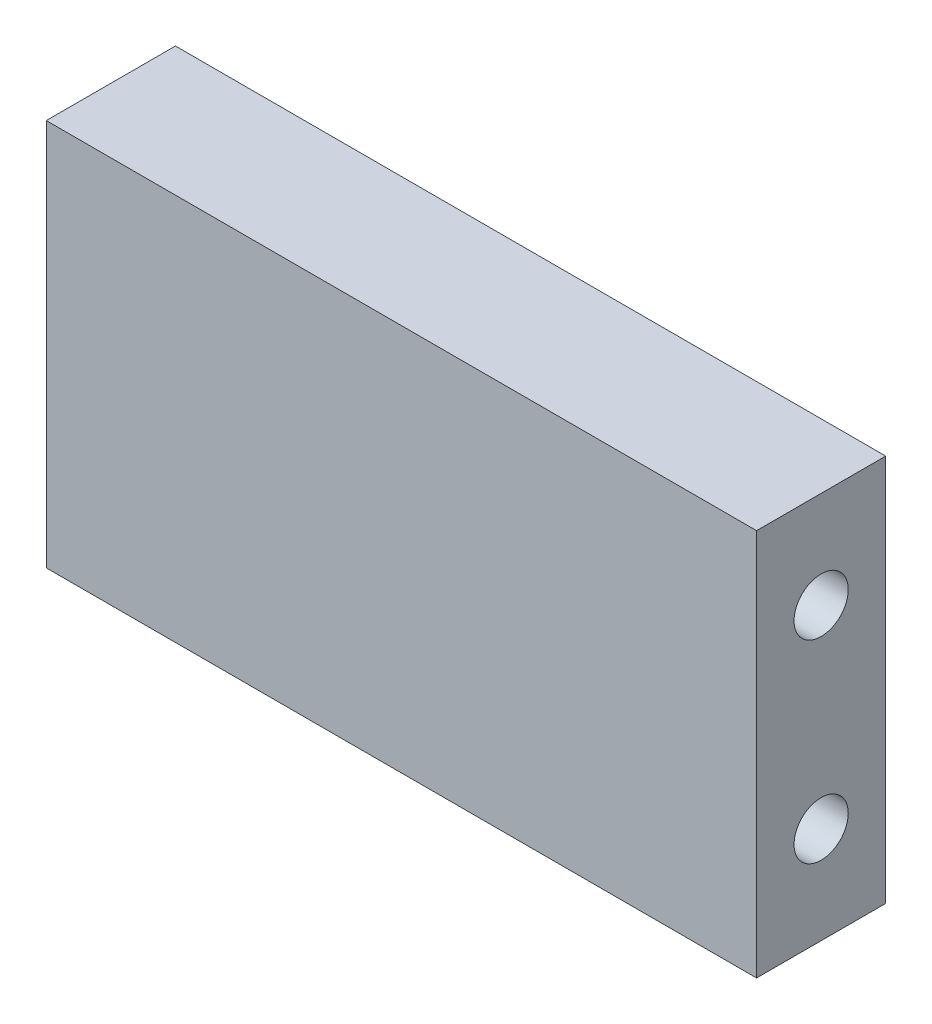
ISO-10303-21;
HEADER;
FILE_DESCRIPTION(('STEP AP214'),'2;1');
FILE_NAME('part.step','',(''),(''),'','','');
FILE_SCHEMA(('AUTOMOTIVE_DESIGN { 1 0 10303 214 1 1 1 1 }'));
ENDSEC;
DATA;
#1=APPLICATION_CONTEXT('core data for automotive mechanical design processes');
#2=APPLICATION_PROTOCOL_DEFINITION('international standard','automotive_design',2000,#1);
#3=PRODUCT_CONTEXT('',#1,'mechanical');
#4=PRODUCT('Part','Part','',(#3));
#5=PRODUCT_RELATED_PRODUCT_CATEGORY('part','',(#4));
#6=PRODUCT_DEFINITION_FORMATION('','',#4);
#7=PRODUCT_DEFINITION_CONTEXT('part definition',#1,'design');
#8=PRODUCT_DEFINITION('design','',#6,#7);
#9=PRODUCT_DEFINITION_SHAPE('','',#8);
#10=(LENGTH_UNIT() NAMED_UNIT(*) SI_UNIT(.MILLI.,.METRE.));
#11=(NAMED_UNIT(*) PLANE_ANGLE_UNIT() SI_UNIT($,.RADIAN.));
#12=(NAMED_UNIT(*) SI_UNIT($,.STERADIAN.) SOLID_ANGLE_UNIT());
#13=UNCERTAINTY_MEASURE_WITH_UNIT(LENGTH_MEASURE(1.E-05),#10,'distance_accuracy_value','');
#14=(GEOMETRIC_REPRESENTATION_CONTEXT(3) GLOBAL_UNCERTAINTY_ASSIGNED_CONTEXT((#13)) GLOBAL_UNIT_ASSIGNED_CONTEXT((#10,
#11,#12)) REPRESENTATION_CONTEXT('',''));
#15=CARTESIAN_POINT('',(0.,0.,0.));
#16=DIRECTION('',(0.,0.,1.));
#17=DIRECTION('',(1.,0.,0.));
#18=AXIS2_PLACEMENT_3D('',#15,#16,#17);
#19=CARTESIAN_POINT('',(27.5,-15.,10.));
#20=DIRECTION('',(-1.,0.,0.));
#21=DIRECTION('',(0.,0.,1.));
#22=AXIS2_PLACEMENT_3D('',#19,#20,#21);
#23=PLANE('',#22);
#24=CARTESIAN_POINT('',(27.5,7.5,5.));
#25=DIRECTION('',(1.,0.,0.));
#26=DIRECTION('',(0.,0.,-1.));
#27=AXIS2_PLACEMENT_3D('',#24,#25,#26);
#28=CIRCLE('',#27,2.09999999999999);
#29=CARTESIAN_POINT('',(27.5,7.5,2.90000000000001));
#30=VERTEX_POINT('',#29);
#31=EDGE_CURVE('E118',#30,#30,#28,.T.);
#32=ORIENTED_EDGE('',*,*,#31,.F.);
#33=EDGE_LOOP('',(#32));
#34=FACE_BOUND('',#33,.T.);
#35=CARTESIAN_POINT('',(27.5,-7.5,5.));
#36=DIRECTION('',(1.,0.,0.));
#37=DIRECTION('',(0.,0.,-1.));
#38=AXIS2_PLACEMENT_3D('',#35,#36,#37);
#39=CIRCLE('',#38,2.09999999999999);
#40=CARTESIAN_POINT('',(27.5,-7.5,2.90000000000001));
#41=VERTEX_POINT('',#40);
#42=EDGE_CURVE('E117',#41,#41,#39,.T.);
#43=ORIENTED_EDGE('',*,*,#42,.F.);
#44=EDGE_LOOP('',(#43));
#45=FACE_BOUND('',#44,.T.);
#46=DIRECTION('',(0.,1.,0.));
#47=VECTOR('',#46,1.);
#48=CARTESIAN_POINT('',(27.5,-15.,0.));
#49=LINE('',#48,#47);
#50=CARTESIAN_POINT('',(27.5,-15.,0.));
#51=VERTEX_POINT('',#50);
#52=CARTESIAN_POINT('',(27.5,15.,0.));
#53=VERTEX_POINT('',#52);
#54=EDGE_CURVE('E147',#51,#53,#49,.T.);
#55=ORIENTED_EDGE('',*,*,#54,.T.);
#56=DIRECTION('',(0.,0.,-1.));
#57=VECTOR('',#56,1.);
#58=CARTESIAN_POINT('',(27.5,15.,10.));
#59=LINE('',#58,#57);
#60=CARTESIAN_POINT('',(27.5,15.,10.));
#61=VERTEX_POINT('',#60);
#62=EDGE_CURVE('E11',#61,#53,#59,.T.);
#63=ORIENTED_EDGE('',*,*,#62,.F.);
#64=DIRECTION('',(0.,1.,0.));
#65=VECTOR('',#64,1.);
#66=CARTESIAN_POINT('',(27.5,-15.,10.));
#67=LINE('',#66,#65);
#68=CARTESIAN_POINT('',(27.5,-15.,10.));
#69=VERTEX_POINT('',#68);
#70=EDGE_CURVE('E148',#69,#61,#67,.T.);
#71=ORIENTED_EDGE('',*,*,#70,.F.);
#72=DIRECTION('',(0.,0.,-1.));
#73=VECTOR('',#72,1.);
#74=CARTESIAN_POINT('',(27.5,-15.,10.));
#75=LINE('',#74,#73);
#76=EDGE_CURVE('E158',#69,#51,#75,.T.);
#77=ORIENTED_EDGE('',*,*,#76,.T.);
#78=EDGE_LOOP('',(#55,#63,#71,#77));
#79=FACE_BOUND('',#78,.T.);
#80=ADVANCED_FACE('F45',(#34,#45,#79),#23,.F.);
#81=CARTESIAN_POINT('',(-27.5,15.,10.));
#82=DIRECTION('',(0.,-1.,0.));
#83=DIRECTION('',(0.,0.,-1.));
#84=AXIS2_PLACEMENT_3D('',#81,#82,#83);
#85=PLANE('',#84);
#86=DIRECTION('',(-1.,0.,0.));
#87=VECTOR('',#86,1.);
#88=CARTESIAN_POINT('',(-27.5,15.,0.));
#89=LINE('',#88,#87);
#90=CARTESIAN_POINT('',(-27.5,15.,0.));
#91=VERTEX_POINT('',#90);
#92=EDGE_CURVE('E162',#53,#91,#89,.T.);
#93=ORIENTED_EDGE('',*,*,#92,.T.);
#94=DIRECTION('',(0.,0.,-1.));
#95=VECTOR('',#94,1.);
#96=CARTESIAN_POINT('',(-27.5,15.,10.));
#97=LINE('',#96,#95);
#98=CARTESIAN_POINT('',(-27.5,15.,10.));
#99=VERTEX_POINT('',#98);
#100=EDGE_CURVE('E54',#99,#91,#97,.T.);
#101=ORIENTED_EDGE('',*,*,#100,.F.);
#102=DIRECTION('',(-1.,0.,0.));
#103=VECTOR('',#102,1.);
#104=CARTESIAN_POINT('',(-27.5,15.,10.));
#105=LINE('',#104,#103);
#106=EDGE_CURVE('E93',#61,#99,#105,.T.);
#107=ORIENTED_EDGE('',*,*,#106,.F.);
#108=ORIENTED_EDGE('',*,*,#62,.T.);
#109=EDGE_LOOP('',(#93,#101,#107,#108));
#110=FACE_BOUND('',#109,.T.);
#111=ADVANCED_FACE('F191',(#110),#85,.F.);
#112=CARTESIAN_POINT('',(-27.5,-15.,10.));
#113=DIRECTION('',(1.,0.,0.));
#114=DIRECTION('',(0.,0.,-1.));
#115=AXIS2_PLACEMENT_3D('',#112,#113,#114);
#116=PLANE('',#115);
#117=CARTESIAN_POINT('',(-27.5,7.5,5.));
#118=DIRECTION('',(-1.,0.,0.));
#119=DIRECTION('',(0.,0.,1.));
#120=AXIS2_PLACEMENT_3D('',#117,#118,#119);
#121=CIRCLE('',#120,2.09999999999999);
#122=CARTESIAN_POINT('',(-27.5,7.5,7.09999999999999));
#123=VERTEX_POINT('',#122);
#124=EDGE_CURVE('E131',#123,#123,#121,.T.);
#125=ORIENTED_EDGE('',*,*,#124,.F.);
#126=EDGE_LOOP('',(#125));
#127=FACE_BOUND('',#126,.T.);
#128=CARTESIAN_POINT('',(-27.5,-7.5,5.));
#129=DIRECTION('',(-1.,0.,0.));
#130=DIRECTION('',(0.,0.,1.));
#131=AXIS2_PLACEMENT_3D('',#128,#129,#130);
#132=CIRCLE('',#131,2.09999999999999);
#133=CARTESIAN_POINT('',(-27.5,-7.5,7.09999999999999));
#134=VERTEX_POINT('',#133);
#135=EDGE_CURVE('E139',#134,#134,#132,.T.);
#136=ORIENTED_EDGE('',*,*,#135,.F.);
#137=EDGE_LOOP('',(#136));
#138=FACE_BOUND('',#137,.T.);
#139=DIRECTION('',(0.,-1.,0.));
#140=VECTOR('',#139,1.);
#141=CARTESIAN_POINT('',(-27.5,-15.,0.));
#142=LINE('',#141,#140);
#143=CARTESIAN_POINT('',(-27.5,-15.,0.));
#144=VERTEX_POINT('',#143);
#145=EDGE_CURVE('E80',#91,#144,#142,.T.);
#146=ORIENTED_EDGE('',*,*,#145,.T.);
#147=DIRECTION('',(0.,0.,-1.));
#148=VECTOR('',#147,1.);
#149=CARTESIAN_POINT('',(-27.5,-15.,10.));
#150=LINE('',#149,#148);
#151=CARTESIAN_POINT('',(-27.5,-15.,10.));
#152=VERTEX_POINT('',#151);
#153=EDGE_CURVE('E171',#152,#144,#150,.T.);
#154=ORIENTED_EDGE('',*,*,#153,.F.);
#155=DIRECTION('',(0.,-1.,0.));
#156=VECTOR('',#155,1.);
#157=CARTESIAN_POINT('',(-27.5,-15.,10.));
#158=LINE('',#157,#156);
#159=EDGE_CURVE('E153',#99,#152,#158,.T.);
#160=ORIENTED_EDGE('',*,*,#159,.F.);
#161=ORIENTED_EDGE('',*,*,#100,.T.);
#162=EDGE_LOOP('',(#146,#154,#160,#161));
#163=FACE_BOUND('',#162,.T.);
#164=ADVANCED_FACE('F175',(#127,#138,#163),#116,.F.);
#165=CARTESIAN_POINT('',(-27.5,-15.,10.));
#166=DIRECTION('',(0.,1.,0.));
#167=DIRECTION('',(0.,0.,1.));
#168=AXIS2_PLACEMENT_3D('',#165,#166,#167);
#169=PLANE('',#168);
#170=DIRECTION('',(1.,0.,0.));
#171=VECTOR('',#170,1.);
#172=CARTESIAN_POINT('',(-27.5,-15.,0.));
#173=LINE('',#172,#171);
#174=EDGE_CURVE('E86',#144,#51,#173,.T.);
#175=ORIENTED_EDGE('',*,*,#174,.T.);
#176=ORIENTED_EDGE('',*,*,#76,.F.);
#177=DIRECTION('',(1.,0.,0.));
#178=VECTOR('',#177,1.);
#179=CARTESIAN_POINT('',(-27.5,-15.,10.));
#180=LINE('',#179,#178);
#181=EDGE_CURVE('E62',#152,#69,#180,.T.);
#182=ORIENTED_EDGE('',*,*,#181,.F.);
#183=ORIENTED_EDGE('',*,*,#153,.T.);
#184=EDGE_LOOP('',(#175,#176,#182,#183));
#185=FACE_BOUND('',#184,.T.);
#186=ADVANCED_FACE('F182',(#185),#169,.F.);
#187=CARTESIAN_POINT('',(0.,0.,10.));
#188=DIRECTION('',(0.,0.,-1.));
#189=DIRECTION('',(-1.,0.,0.));
#190=AXIS2_PLACEMENT_3D('',#187,#188,#189);
#191=PLANE('',#190);
#192=ORIENTED_EDGE('',*,*,#70,.T.);
#193=ORIENTED_EDGE('',*,*,#106,.T.);
#194=ORIENTED_EDGE('',*,*,#159,.T.);
#195=ORIENTED_EDGE('',*,*,#181,.T.);
#196=EDGE_LOOP('',(#192,#193,#194,#195));
#197=FACE_BOUND('',#196,.T.);
#198=ADVANCED_FACE('F184',(#197),#191,.F.);
#199=CARTESIAN_POINT('',(0.,0.,0.));
#200=DIRECTION('',(0.,0.,-1.));
#201=DIRECTION('',(-1.,0.,0.));
#202=AXIS2_PLACEMENT_3D('',#199,#200,#201);
#203=PLANE('',#202);
#204=ORIENTED_EDGE('',*,*,#54,.F.);
#205=ORIENTED_EDGE('',*,*,#174,.F.);
#206=ORIENTED_EDGE('',*,*,#145,.F.);
#207=ORIENTED_EDGE('',*,*,#92,.F.);
#208=EDGE_LOOP('',(#204,#205,#206,#207));
#209=FACE_BOUND('',#208,.T.);
#210=ADVANCED_FACE('F178',(#209),#203,.T.);
#211=CARTESIAN_POINT('',(-13.5,-7.5,5.));
#212=DIRECTION('',(-1.,0.,0.));
#213=DIRECTION('',(0.,0.,1.));
#214=AXIS2_PLACEMENT_3D('',#211,#212,#213);
#215=CONICAL_SURFACE('',#214,2.09999999999999,1.02974425867665);
#216=CARTESIAN_POINT('',(-12.2381927000421,-7.5,5.));
#217=VERTEX_POINT('',#216);
#218=VERTEX_LOOP('',#217);
#219=FACE_BOUND('',#218,.T.);
#220=CARTESIAN_POINT('',(-13.5,-7.5,5.));
#221=DIRECTION('',(-1.,0.,0.));
#222=DIRECTION('',(0.,0.,1.));
#223=AXIS2_PLACEMENT_3D('',#220,#221,#222);
#224=CIRCLE('',#223,2.09999999999999);
#225=CARTESIAN_POINT('',(-13.5,-7.5,7.09999999999999));
#226=VERTEX_POINT('',#225);
#227=EDGE_CURVE('E143',#226,#226,#224,.T.);
#228=ORIENTED_EDGE('',*,*,#227,.T.);
#229=EDGE_LOOP('',(#228));
#230=FACE_BOUND('',#229,.T.);
#231=ADVANCED_FACE('F227',(#219,#230),#215,.F.);
#232=CARTESIAN_POINT('',(-27.5,-7.5,5.));
#233=DIRECTION('',(-1.,0.,0.));
#234=DIRECTION('',(0.,0.,1.));
#235=AXIS2_PLACEMENT_3D('',#232,#233,#234);
#236=CYLINDRICAL_SURFACE('',#235,2.09999999999999);
#237=ORIENTED_EDGE('',*,*,#227,.F.);
#238=EDGE_LOOP('',(#237));
#239=FACE_BOUND('',#238,.T.);
#240=ORIENTED_EDGE('',*,*,#135,.T.);
#241=EDGE_LOOP('',(#240));
#242=FACE_BOUND('',#241,.T.);
#243=ADVANCED_FACE('F223',(#239,#242),#236,.F.);
#244=CARTESIAN_POINT('',(-13.5,7.5,5.));
#245=DIRECTION('',(-1.,0.,0.));
#246=DIRECTION('',(0.,0.,1.));
#247=AXIS2_PLACEMENT_3D('',#244,#245,#246);
#248=CONICAL_SURFACE('',#247,2.09999999999999,1.02974425867665);
#249=CARTESIAN_POINT('',(-12.2381927000421,7.5,5.));
#250=VERTEX_POINT('',#249);
#251=VERTEX_LOOP('',#250);
#252=FACE_BOUND('',#251,.T.);
#253=CARTESIAN_POINT('',(-13.5,7.5,5.));
#254=DIRECTION('',(-1.,0.,0.));
#255=DIRECTION('',(0.,0.,1.));
#256=AXIS2_PLACEMENT_3D('',#253,#254,#255);
#257=CIRCLE('',#256,2.09999999999999);
#258=CARTESIAN_POINT('',(-13.5,7.5,7.09999999999999));
#259=VERTEX_POINT('',#258);
#260=EDGE_CURVE('E135',#259,#259,#257,.T.);
#261=ORIENTED_EDGE('',*,*,#260,.T.);
#262=EDGE_LOOP('',(#261));
#263=FACE_BOUND('',#262,.T.);
#264=ADVANCED_FACE('F219',(#252,#263),#248,.F.);
#265=CARTESIAN_POINT('',(-27.5,7.5,5.));
#266=DIRECTION('',(-1.,0.,0.));
#267=DIRECTION('',(0.,0.,1.));
#268=AXIS2_PLACEMENT_3D('',#265,#266,#267);
#269=CYLINDRICAL_SURFACE('',#268,2.09999999999999);
#270=ORIENTED_EDGE('',*,*,#260,.F.);
#271=EDGE_LOOP('',(#270));
#272=FACE_BOUND('',#271,.T.);
#273=ORIENTED_EDGE('',*,*,#124,.T.);
#274=EDGE_LOOP('',(#273));
#275=FACE_BOUND('',#274,.T.);
#276=ADVANCED_FACE('F211',(#272,#275),#269,.F.);
#277=CARTESIAN_POINT('',(13.5,-7.5,5.));
#278=DIRECTION('',(1.,0.,0.));
#279=DIRECTION('',(0.,0.,-1.));
#280=AXIS2_PLACEMENT_3D('',#277,#278,#279);
#281=CONICAL_SURFACE('',#280,2.09999999999999,1.02974425867665);
#282=CARTESIAN_POINT('',(12.2381927000421,-7.5,5.));
#283=VERTEX_POINT('',#282);
#284=VERTEX_LOOP('',#283);
#285=FACE_BOUND('',#284,.T.);
#286=CARTESIAN_POINT('',(13.5,-7.5,5.));
#287=DIRECTION('',(1.,0.,0.));
#288=DIRECTION('',(0.,0.,-1.));
#289=AXIS2_PLACEMENT_3D('',#286,#287,#288);
#290=CIRCLE('',#289,2.09999999999999);
#291=CARTESIAN_POINT('',(13.5,-7.5,2.90000000000002));
#292=VERTEX_POINT('',#291);
#293=EDGE_CURVE('E123',#292,#292,#290,.T.);
#294=ORIENTED_EDGE('',*,*,#293,.T.);
#295=EDGE_LOOP('',(#294));
#296=FACE_BOUND('',#295,.T.);
#297=ADVANCED_FACE('F205',(#285,#296),#281,.F.);
#298=CARTESIAN_POINT('',(27.5,-7.5,5.));
#299=DIRECTION('',(1.,0.,0.));
#300=DIRECTION('',(0.,0.,-1.));
#301=AXIS2_PLACEMENT_3D('',#298,#299,#300);
#302=CYLINDRICAL_SURFACE('',#301,2.09999999999999);
#303=ORIENTED_EDGE('',*,*,#293,.F.);
#304=EDGE_LOOP('',(#303));
#305=FACE_BOUND('',#304,.T.);
#306=ORIENTED_EDGE('',*,*,#42,.T.);
#307=EDGE_LOOP('',(#306));
#308=FACE_BOUND('',#307,.T.);
#309=ADVANCED_FACE('F110',(#305,#308),#302,.F.);
#310=CARTESIAN_POINT('',(13.5,7.5,5.));
#311=DIRECTION('',(1.,0.,0.));
#312=DIRECTION('',(0.,0.,-1.));
#313=AXIS2_PLACEMENT_3D('',#310,#311,#312);
#314=CONICAL_SURFACE('',#313,2.09999999999999,1.02974425867665);
#315=CARTESIAN_POINT('',(12.2381927000421,7.5,5.));
#316=VERTEX_POINT('',#315);
#317=VERTEX_LOOP('',#316);
#318=FACE_BOUND('',#317,.T.);
#319=CARTESIAN_POINT('',(13.5,7.5,5.));
#320=DIRECTION('',(1.,0.,0.));
#321=DIRECTION('',(0.,0.,-1.));
#322=AXIS2_PLACEMENT_3D('',#319,#320,#321);
#323=CIRCLE('',#322,2.09999999999999);
#324=CARTESIAN_POINT('',(13.5,7.5,2.90000000000001));
#325=VERTEX_POINT('',#324);
#326=EDGE_CURVE('E114',#325,#325,#323,.T.);
#327=ORIENTED_EDGE('',*,*,#326,.T.);
#328=EDGE_LOOP('',(#327));
#329=FACE_BOUND('',#328,.T.);
#330=ADVANCED_FACE('F106',(#318,#329),#314,.F.);
#331=CARTESIAN_POINT('',(27.5,7.5,5.));
#332=DIRECTION('',(1.,0.,0.));
#333=DIRECTION('',(0.,0.,-1.));
#334=AXIS2_PLACEMENT_3D('',#331,#332,#333);
#335=CYLINDRICAL_SURFACE('',#334,2.09999999999999);
#336=ORIENTED_EDGE('',*,*,#326,.F.);
#337=EDGE_LOOP('',(#336));
#338=FACE_BOUND('',#337,.T.);
#339=ORIENTED_EDGE('',*,*,#31,.T.);
#340=EDGE_LOOP('',(#339));
#341=FACE_BOUND('',#340,.T.);
#342=ADVANCED_FACE('F109',(#338,#341),#335,.F.);
#343=CLOSED_SHELL('',(#80,#111,#164,#186,#198,#210,#231,#243,#264,#276,#297,#309,#330,#342));
#344=MANIFOLD_SOLID_BREP('B2',#343);
#345=ADVANCED_BREP_SHAPE_REPRESENTATION('',(#18,#344),#14);
#346=SHAPE_DEFINITION_REPRESENTATION(#9,#345);
ENDSEC;
END-ISO-10303-21;
